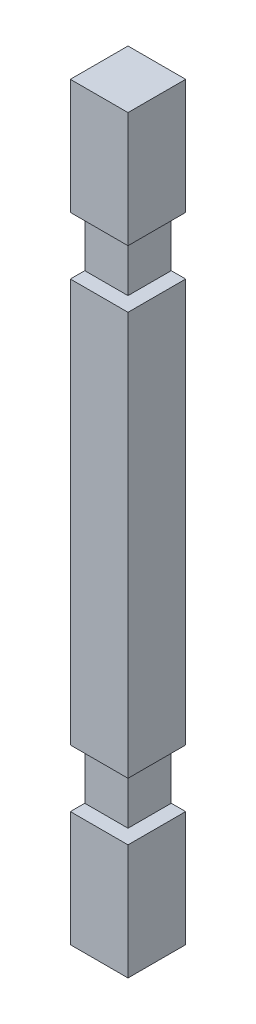
ISO-10303-21;
HEADER;
FILE_DESCRIPTION(('STEP AP214'),'2;1');
FILE_NAME('part.step','',(''),(''),'','','');
FILE_SCHEMA(('AUTOMOTIVE_DESIGN { 1 0 10303 214 1 1 1 1 }'));
ENDSEC;
DATA;
#1=APPLICATION_CONTEXT('core data for automotive mechanical design processes');
#2=APPLICATION_PROTOCOL_DEFINITION('international standard','automotive_design',2000,#1);
#3=PRODUCT_CONTEXT('',#1,'mechanical');
#4=PRODUCT('Part','Part','',(#3));
#5=PRODUCT_RELATED_PRODUCT_CATEGORY('part','',(#4));
#6=PRODUCT_DEFINITION_FORMATION('','',#4);
#7=PRODUCT_DEFINITION_CONTEXT('part definition',#1,'design');
#8=PRODUCT_DEFINITION('design','',#6,#7);
#9=PRODUCT_DEFINITION_SHAPE('','',#8);
#10=(LENGTH_UNIT() NAMED_UNIT(*) SI_UNIT(.MILLI.,.METRE.));
#11=(NAMED_UNIT(*) PLANE_ANGLE_UNIT() SI_UNIT($,.RADIAN.));
#12=(NAMED_UNIT(*) SI_UNIT($,.STERADIAN.) SOLID_ANGLE_UNIT());
#13=UNCERTAINTY_MEASURE_WITH_UNIT(LENGTH_MEASURE(1.E-05),#10,'distance_accuracy_value','');
#14=(GEOMETRIC_REPRESENTATION_CONTEXT(3) GLOBAL_UNCERTAINTY_ASSIGNED_CONTEXT((#13)) GLOBAL_UNIT_ASSIGNED_CONTEXT((#10,
#11,#12)) REPRESENTATION_CONTEXT('',''));
#15=CARTESIAN_POINT('',(0.,0.,0.));
#16=DIRECTION('',(0.,0.,1.));
#17=DIRECTION('',(1.,0.,0.));
#18=AXIS2_PLACEMENT_3D('',#15,#16,#17);
#19=CARTESIAN_POINT('',(25.3999999999999,330.2,50.8));
#20=DIRECTION('',(-1.,0.,0.));
#21=DIRECTION('',(0.,-1.,0.));
#22=AXIS2_PLACEMENT_3D('',#19,#20,#21);
#23=PLANE('',#22);
#24=DIRECTION('',(0.,0.,1.));
#25=VECTOR('',#24,1.);
#26=CARTESIAN_POINT('',(25.4,-177.8,38.1));
#27=LINE('',#26,#25);
#28=CARTESIAN_POINT('',(25.4,-177.8,0.));
#29=VERTEX_POINT('',#28);
#30=CARTESIAN_POINT('',(25.4,-177.8,50.8));
#31=VERTEX_POINT('',#30);
#32=EDGE_CURVE('E62',#29,#31,#27,.T.);
#33=ORIENTED_EDGE('',*,*,#32,.F.);
#34=DIRECTION('',(0.,1.,0.));
#35=VECTOR('',#34,1.);
#36=CARTESIAN_POINT('',(25.3999999999999,330.2,0.));
#37=LINE('',#36,#35);
#38=CARTESIAN_POINT('',(25.3999999999999,177.8,0.));
#39=VERTEX_POINT('',#38);
#40=EDGE_CURVE('E289',#29,#39,#37,.T.);
#41=ORIENTED_EDGE('',*,*,#40,.T.);
#42=DIRECTION('',(0.,0.,1.));
#43=VECTOR('',#42,1.);
#44=CARTESIAN_POINT('',(25.4,177.8,38.1));
#45=LINE('',#44,#43);
#46=CARTESIAN_POINT('',(25.4,177.8,50.8));
#47=VERTEX_POINT('',#46);
#48=EDGE_CURVE('E253',#39,#47,#45,.T.);
#49=ORIENTED_EDGE('',*,*,#48,.T.);
#50=DIRECTION('',(0.,1.,0.));
#51=VECTOR('',#50,1.);
#52=CARTESIAN_POINT('',(25.3999999999999,330.2,50.8));
#53=LINE('',#52,#51);
#54=EDGE_CURVE('E274',#31,#47,#53,.T.);
#55=ORIENTED_EDGE('',*,*,#54,.F.);
#56=EDGE_LOOP('',(#33,#41,#49,#55));
#57=FACE_BOUND('',#56,.T.);
#58=ADVANCED_FACE('F39',(#57),#23,.F.);
#59=CARTESIAN_POINT('',(0.,0.,38.1));
#60=DIRECTION('',(0.,0.,-1.));
#61=DIRECTION('',(-1.,0.,0.));
#62=AXIS2_PLACEMENT_3D('',#59,#60,#61);
#63=PLANE('',#62);
#64=DIRECTION('',(0.,-1.,0.));
#65=VECTOR('',#64,1.);
#66=CARTESIAN_POINT('',(12.6999999999999,0.,38.1));
#67=LINE('',#66,#65);
#68=CARTESIAN_POINT('',(12.7,-177.8,38.1));
#69=VERTEX_POINT('',#68);
#70=CARTESIAN_POINT('',(12.7,-228.6,38.1));
#71=VERTEX_POINT('',#70);
#72=EDGE_CURVE('E11',#69,#71,#67,.T.);
#73=ORIENTED_EDGE('',*,*,#72,.F.);
#74=DIRECTION('',(-1.,0.,0.));
#75=VECTOR('',#74,1.);
#76=CARTESIAN_POINT('',(25.4,-177.8,38.1));
#77=LINE('',#76,#75);
#78=CARTESIAN_POINT('',(-25.4,-177.8,38.1));
#79=VERTEX_POINT('',#78);
#80=EDGE_CURVE('E184',#69,#79,#77,.T.);
#81=ORIENTED_EDGE('',*,*,#80,.T.);
#82=DIRECTION('',(0.,-1.,0.));
#83=VECTOR('',#82,1.);
#84=CARTESIAN_POINT('',(-25.4,-177.8,38.1));
#85=LINE('',#84,#83);
#86=CARTESIAN_POINT('',(-25.4,-228.6,38.1));
#87=VERTEX_POINT('',#86);
#88=EDGE_CURVE('E187',#79,#87,#85,.T.);
#89=ORIENTED_EDGE('',*,*,#88,.T.);
#90=DIRECTION('',(1.,0.,0.));
#91=VECTOR('',#90,1.);
#92=CARTESIAN_POINT('',(25.4,-228.6,38.1));
#93=LINE('',#92,#91);
#94=EDGE_CURVE('E191',#87,#71,#93,.T.);
#95=ORIENTED_EDGE('',*,*,#94,.T.);
#96=EDGE_LOOP('',(#73,#81,#89,#95));
#97=FACE_BOUND('',#96,.T.);
#98=ADVANCED_FACE('F377',(#97),#63,.F.);
#99=CARTESIAN_POINT('',(0.,0.,50.8));
#100=DIRECTION('',(0.,0.,1.));
#101=DIRECTION('',(1.,0.,0.));
#102=AXIS2_PLACEMENT_3D('',#99,#100,#101);
#103=PLANE('',#102);
#104=DIRECTION('',(1.,0.,0.));
#105=VECTOR('',#104,1.);
#106=CARTESIAN_POINT('',(25.4,-228.6,50.8));
#107=LINE('',#106,#105);
#108=CARTESIAN_POINT('',(-25.4,-228.6,50.8));
#109=VERTEX_POINT('',#108);
#110=CARTESIAN_POINT('',(25.4,-228.6,50.8));
#111=VERTEX_POINT('',#110);
#112=EDGE_CURVE('E188',#109,#111,#107,.T.);
#113=ORIENTED_EDGE('',*,*,#112,.F.);
#114=DIRECTION('',(0.,-1.,0.));
#115=VECTOR('',#114,1.);
#116=CARTESIAN_POINT('',(-25.4,330.2,50.8));
#117=LINE('',#116,#115);
#118=CARTESIAN_POINT('',(-25.4,-330.2,50.8));
#119=VERTEX_POINT('',#118);
#120=EDGE_CURVE('E265',#109,#119,#117,.T.);
#121=ORIENTED_EDGE('',*,*,#120,.T.);
#122=DIRECTION('',(1.,0.,0.));
#123=VECTOR('',#122,1.);
#124=CARTESIAN_POINT('',(-25.4,-330.2,50.8));
#125=LINE('',#124,#123);
#126=CARTESIAN_POINT('',(25.4,-330.2,50.8));
#127=VERTEX_POINT('',#126);
#128=EDGE_CURVE('E263',#119,#127,#125,.T.);
#129=ORIENTED_EDGE('',*,*,#128,.T.);
#130=EDGE_CURVE('E269',#127,#111,#53,.T.);
#131=ORIENTED_EDGE('',*,*,#130,.T.);
#132=EDGE_LOOP('',(#113,#121,#129,#131));
#133=FACE_BOUND('',#132,.T.);
#134=ADVANCED_FACE('F383',(#133),#103,.T.);
#135=DIRECTION('',(0.,0.,1.));
#136=VECTOR('',#135,1.);
#137=CARTESIAN_POINT('',(25.4,228.6,38.1));
#138=LINE('',#137,#136);
#139=CARTESIAN_POINT('',(25.3999999999999,228.6,0.));
#140=VERTEX_POINT('',#139);
#141=CARTESIAN_POINT('',(25.4,228.6,50.8));
#142=VERTEX_POINT('',#141);
#143=EDGE_CURVE('E250',#140,#142,#138,.T.);
#144=ORIENTED_EDGE('',*,*,#143,.F.);
#145=CARTESIAN_POINT('',(25.3999999999999,330.2,0.));
#146=VERTEX_POINT('',#145);
#147=EDGE_CURVE('E284',#140,#146,#37,.T.);
#148=ORIENTED_EDGE('',*,*,#147,.T.);
#149=DIRECTION('',(0.,0.,-1.));
#150=VECTOR('',#149,1.);
#151=CARTESIAN_POINT('',(25.3999999999999,330.2,50.8));
#152=LINE('',#151,#150);
#153=CARTESIAN_POINT('',(25.3999999999999,330.2,50.8));
#154=VERTEX_POINT('',#153);
#155=EDGE_CURVE('E295',#154,#146,#152,.T.);
#156=ORIENTED_EDGE('',*,*,#155,.F.);
#157=EDGE_CURVE('E268',#142,#154,#53,.T.);
#158=ORIENTED_EDGE('',*,*,#157,.F.);
#159=EDGE_LOOP('',(#144,#148,#156,#158));
#160=FACE_BOUND('',#159,.T.);
#161=ADVANCED_FACE('F343',(#160),#23,.F.);
#162=CARTESIAN_POINT('',(0.,0.,38.1));
#163=DIRECTION('',(0.,0.,1.));
#164=DIRECTION('',(1.,0.,0.));
#165=AXIS2_PLACEMENT_3D('',#162,#163,#164);
#166=PLANE('',#165);
#167=DIRECTION('',(1.,0.,0.));
#168=VECTOR('',#167,1.);
#169=CARTESIAN_POINT('',(-25.4,177.8,38.1));
#170=LINE('',#169,#168);
#171=CARTESIAN_POINT('',(-25.4,177.8,38.1));
#172=VERTEX_POINT('',#171);
#173=CARTESIAN_POINT('',(12.6999999999999,177.8,38.1));
#174=VERTEX_POINT('',#173);
#175=EDGE_CURVE('E231',#172,#174,#170,.T.);
#176=ORIENTED_EDGE('',*,*,#175,.T.);
#177=DIRECTION('',(0.,1.,0.));
#178=VECTOR('',#177,1.);
#179=CARTESIAN_POINT('',(12.7,0.,38.1));
#180=LINE('',#179,#178);
#181=CARTESIAN_POINT('',(12.6999999999999,228.6,38.1));
#182=VERTEX_POINT('',#181);
#183=EDGE_CURVE('E48',#174,#182,#180,.T.);
#184=ORIENTED_EDGE('',*,*,#183,.T.);
#185=DIRECTION('',(-1.,0.,0.));
#186=VECTOR('',#185,1.);
#187=CARTESIAN_POINT('',(-25.4,228.6,38.1));
#188=LINE('',#187,#186);
#189=CARTESIAN_POINT('',(-25.4,228.6,38.1));
#190=VERTEX_POINT('',#189);
#191=EDGE_CURVE('E236',#182,#190,#188,.T.);
#192=ORIENTED_EDGE('',*,*,#191,.T.);
#193=DIRECTION('',(0.,-1.,0.));
#194=VECTOR('',#193,1.);
#195=CARTESIAN_POINT('',(-25.4,228.6,38.1));
#196=LINE('',#195,#194);
#197=EDGE_CURVE('E227',#190,#172,#196,.T.);
#198=ORIENTED_EDGE('',*,*,#197,.T.);
#199=EDGE_LOOP('',(#176,#184,#192,#198));
#200=FACE_BOUND('',#199,.T.);
#201=ADVANCED_FACE('F310',(#200),#166,.T.);
#202=DIRECTION('',(-1.,0.,0.));
#203=VECTOR('',#202,1.);
#204=CARTESIAN_POINT('',(-25.4,228.6,50.8));
#205=LINE('',#204,#203);
#206=CARTESIAN_POINT('',(-25.4,228.6,50.8));
#207=VERTEX_POINT('',#206);
#208=EDGE_CURVE('E232',#142,#207,#205,.T.);
#209=ORIENTED_EDGE('',*,*,#208,.F.);
#210=ORIENTED_EDGE('',*,*,#157,.T.);
#211=DIRECTION('',(-1.,0.,0.));
#212=VECTOR('',#211,1.);
#213=CARTESIAN_POINT('',(-25.4,330.2,50.8));
#214=LINE('',#213,#212);
#215=CARTESIAN_POINT('',(-25.4,330.2,50.8));
#216=VERTEX_POINT('',#215);
#217=EDGE_CURVE('E273',#154,#216,#214,.T.);
#218=ORIENTED_EDGE('',*,*,#217,.T.);
#219=EDGE_CURVE('E259',#216,#207,#117,.T.);
#220=ORIENTED_EDGE('',*,*,#219,.T.);
#221=EDGE_LOOP('',(#209,#210,#218,#220));
#222=FACE_BOUND('',#221,.T.);
#223=ADVANCED_FACE('F339',(#222),#103,.T.);
#224=CARTESIAN_POINT('',(-25.4,330.2,50.8));
#225=DIRECTION('',(1.,0.,0.));
#226=DIRECTION('',(0.,1.,0.));
#227=AXIS2_PLACEMENT_3D('',#224,#225,#226);
#228=PLANE('',#227);
#229=CARTESIAN_POINT('',(-25.4,-304.8,25.4));
#230=DIRECTION('',(-1.,0.,0.));
#231=DIRECTION('',(0.,-1.,0.));
#232=AXIS2_PLACEMENT_3D('',#229,#230,#231);
#233=CIRCLE('',#232,8.);
#234=CARTESIAN_POINT('',(-25.4,-312.8,25.4));
#235=VERTEX_POINT('',#234);
#236=EDGE_CURVE('E441',#235,#235,#233,.T.);
#237=ORIENTED_EDGE('',*,*,#236,.F.);
#238=EDGE_LOOP('',(#237));
#239=FACE_BOUND('',#238,.T.);
#240=CARTESIAN_POINT('',(-25.4,304.8,25.4));
#241=DIRECTION('',(-1.,0.,0.));
#242=DIRECTION('',(0.,-1.,0.));
#243=AXIS2_PLACEMENT_3D('',#240,#241,#242);
#244=CIRCLE('',#243,8.);
#245=CARTESIAN_POINT('',(-25.4,296.8,25.4));
#246=VERTEX_POINT('',#245);
#247=EDGE_CURVE('E453',#246,#246,#244,.T.);
#248=ORIENTED_EDGE('',*,*,#247,.F.);
#249=EDGE_LOOP('',(#248));
#250=FACE_BOUND('',#249,.T.);
#251=ORIENTED_EDGE('',*,*,#120,.F.);
#252=DIRECTION('',(0.,0.,1.));
#253=VECTOR('',#252,1.);
#254=CARTESIAN_POINT('',(-25.4,-228.6,38.1));
#255=LINE('',#254,#253);
#256=EDGE_CURVE('E201',#87,#109,#255,.T.);
#257=ORIENTED_EDGE('',*,*,#256,.F.);
#258=ORIENTED_EDGE('',*,*,#88,.F.);
#259=DIRECTION('',(0.,0.,1.));
#260=VECTOR('',#259,1.);
#261=CARTESIAN_POINT('',(-25.4,-177.8,38.1));
#262=LINE('',#261,#260);
#263=CARTESIAN_POINT('',(-25.4,-177.8,50.8));
#264=VERTEX_POINT('',#263);
#265=EDGE_CURVE('E204',#79,#264,#262,.T.);
#266=ORIENTED_EDGE('',*,*,#265,.T.);
#267=CARTESIAN_POINT('',(-25.4,177.8,50.8));
#268=VERTEX_POINT('',#267);
#269=EDGE_CURVE('E264',#268,#264,#117,.T.);
#270=ORIENTED_EDGE('',*,*,#269,.F.);
#271=DIRECTION('',(0.,0.,1.));
#272=VECTOR('',#271,1.);
#273=CARTESIAN_POINT('',(-25.4,177.8,38.1));
#274=LINE('',#273,#272);
#275=EDGE_CURVE('E239',#172,#268,#274,.T.);
#276=ORIENTED_EDGE('',*,*,#275,.F.);
#277=ORIENTED_EDGE('',*,*,#197,.F.);
#278=DIRECTION('',(0.,0.,1.));
#279=VECTOR('',#278,1.);
#280=CARTESIAN_POINT('',(-25.4,228.6,38.1));
#281=LINE('',#280,#279);
#282=EDGE_CURVE('E245',#190,#207,#281,.T.);
#283=ORIENTED_EDGE('',*,*,#282,.T.);
#284=ORIENTED_EDGE('',*,*,#219,.F.);
#285=DIRECTION('',(0.,0.,-1.));
#286=VECTOR('',#285,1.);
#287=CARTESIAN_POINT('',(-25.4,330.2,50.8));
#288=LINE('',#287,#286);
#289=CARTESIAN_POINT('',(-25.4,330.2,0.));
#290=VERTEX_POINT('',#289);
#291=EDGE_CURVE('E277',#216,#290,#288,.T.);
#292=ORIENTED_EDGE('',*,*,#291,.T.);
#293=DIRECTION('',(0.,-1.,0.));
#294=VECTOR('',#293,1.);
#295=CARTESIAN_POINT('',(-25.4,330.2,0.));
#296=LINE('',#295,#294);
#297=CARTESIAN_POINT('',(-25.4,-330.2,0.));
#298=VERTEX_POINT('',#297);
#299=EDGE_CURVE('E249',#290,#298,#296,.T.);
#300=ORIENTED_EDGE('',*,*,#299,.T.);
#301=DIRECTION('',(0.,0.,-1.));
#302=VECTOR('',#301,1.);
#303=CARTESIAN_POINT('',(-25.4,-330.2,50.8));
#304=LINE('',#303,#302);
#305=EDGE_CURVE('E303',#119,#298,#304,.T.);
#306=ORIENTED_EDGE('',*,*,#305,.F.);
#307=EDGE_LOOP('',(#251,#257,#258,#266,#270,#276,#277,#283,#284,#292,#300,#306));
#308=FACE_BOUND('',#307,.T.);
#309=ADVANCED_FACE('F41',(#239,#250,#308),#228,.F.);
#310=CARTESIAN_POINT('',(-25.4,-330.2,50.8));
#311=DIRECTION('',(0.,1.,0.));
#312=DIRECTION('',(0.,0.,1.));
#313=AXIS2_PLACEMENT_3D('',#310,#311,#312);
#314=PLANE('',#313);
#315=DIRECTION('',(1.,0.,0.));
#316=VECTOR('',#315,1.);
#317=CARTESIAN_POINT('',(-25.4,-330.2,0.));
#318=LINE('',#317,#316);
#319=CARTESIAN_POINT('',(25.4,-330.2,0.));
#320=VERTEX_POINT('',#319);
#321=EDGE_CURVE('E281',#298,#320,#318,.T.);
#322=ORIENTED_EDGE('',*,*,#321,.T.);
#323=DIRECTION('',(0.,0.,-1.));
#324=VECTOR('',#323,1.);
#325=CARTESIAN_POINT('',(25.4,-330.2,50.8));
#326=LINE('',#325,#324);
#327=EDGE_CURVE('E299',#127,#320,#326,.T.);
#328=ORIENTED_EDGE('',*,*,#327,.F.);
#329=ORIENTED_EDGE('',*,*,#128,.F.);
#330=ORIENTED_EDGE('',*,*,#305,.T.);
#331=EDGE_LOOP('',(#322,#328,#329,#330));
#332=FACE_BOUND('',#331,.T.);
#333=ADVANCED_FACE('F353',(#332),#314,.F.);
#334=CARTESIAN_POINT('',(25.4,-228.6,0.));
#335=VERTEX_POINT('',#334);
#336=EDGE_CURVE('E285',#320,#335,#37,.T.);
#337=ORIENTED_EDGE('',*,*,#336,.T.);
#338=DIRECTION('',(0.,0.,1.));
#339=VECTOR('',#338,1.);
#340=CARTESIAN_POINT('',(25.4,-228.6,38.1));
#341=LINE('',#340,#339);
#342=EDGE_CURVE('E165',#335,#111,#341,.T.);
#343=ORIENTED_EDGE('',*,*,#342,.T.);
#344=ORIENTED_EDGE('',*,*,#130,.F.);
#345=ORIENTED_EDGE('',*,*,#327,.T.);
#346=EDGE_LOOP('',(#337,#343,#344,#345));
#347=FACE_BOUND('',#346,.T.);
#348=ADVANCED_FACE('F379',(#347),#23,.F.);
#349=CARTESIAN_POINT('',(-25.4,330.2,50.8));
#350=DIRECTION('',(0.,-1.,0.));
#351=DIRECTION('',(0.,0.,-1.));
#352=AXIS2_PLACEMENT_3D('',#349,#350,#351);
#353=PLANE('',#352);
#354=DIRECTION('',(-1.,0.,0.));
#355=VECTOR('',#354,1.);
#356=CARTESIAN_POINT('',(-25.4,330.2,0.));
#357=LINE('',#356,#355);
#358=EDGE_CURVE('E288',#146,#290,#357,.T.);
#359=ORIENTED_EDGE('',*,*,#358,.T.);
#360=ORIENTED_EDGE('',*,*,#291,.F.);
#361=ORIENTED_EDGE('',*,*,#217,.F.);
#362=ORIENTED_EDGE('',*,*,#155,.T.);
#363=EDGE_LOOP('',(#359,#360,#361,#362));
#364=FACE_BOUND('',#363,.T.);
#365=ADVANCED_FACE('F347',(#364),#353,.F.);
#366=DIRECTION('',(-1.,0.,0.));
#367=VECTOR('',#366,1.);
#368=CARTESIAN_POINT('',(25.4,-177.8,50.8));
#369=LINE('',#368,#367);
#370=EDGE_CURVE('E182',#31,#264,#369,.T.);
#371=ORIENTED_EDGE('',*,*,#370,.F.);
#372=ORIENTED_EDGE('',*,*,#54,.T.);
#373=DIRECTION('',(1.,0.,0.));
#374=VECTOR('',#373,1.);
#375=CARTESIAN_POINT('',(-25.4,177.8,50.8));
#376=LINE('',#375,#374);
#377=EDGE_CURVE('E223',#268,#47,#376,.T.);
#378=ORIENTED_EDGE('',*,*,#377,.F.);
#379=ORIENTED_EDGE('',*,*,#269,.T.);
#380=EDGE_LOOP('',(#371,#372,#378,#379));
#381=FACE_BOUND('',#380,.T.);
#382=ADVANCED_FACE('F331',(#381),#103,.T.);
#383=CARTESIAN_POINT('',(0.,0.,0.));
#384=DIRECTION('',(0.,0.,1.));
#385=DIRECTION('',(1.,0.,0.));
#386=AXIS2_PLACEMENT_3D('',#383,#384,#385);
#387=PLANE('',#386);
#388=CARTESIAN_POINT('',(0.,-304.8,0.));
#389=DIRECTION('',(0.,0.,-1.));
#390=DIRECTION('',(-1.,0.,0.));
#391=AXIS2_PLACEMENT_3D('',#388,#389,#390);
#392=CIRCLE('',#391,8.00000000000002);
#393=CARTESIAN_POINT('',(-7.99999999999999,-304.8,0.));
#394=VERTEX_POINT('',#393);
#395=EDGE_CURVE('E440',#394,#394,#392,.T.);
#396=ORIENTED_EDGE('',*,*,#395,.F.);
#397=EDGE_LOOP('',(#396));
#398=FACE_BOUND('',#397,.T.);
#399=CARTESIAN_POINT('',(-1.11022302462516E-13,304.8,0.));
#400=DIRECTION('',(0.,0.,-1.));
#401=DIRECTION('',(-1.,0.,0.));
#402=AXIS2_PLACEMENT_3D('',#399,#400,#401);
#403=CIRCLE('',#402,8.00000000000002);
#404=CARTESIAN_POINT('',(-8.00000000000013,304.8,0.));
#405=VERTEX_POINT('',#404);
#406=EDGE_CURVE('E459',#405,#405,#403,.T.);
#407=ORIENTED_EDGE('',*,*,#406,.F.);
#408=EDGE_LOOP('',(#407));
#409=FACE_BOUND('',#408,.T.);
#410=ORIENTED_EDGE('',*,*,#40,.F.);
#411=DIRECTION('',(1.,0.,0.));
#412=VECTOR('',#411,1.);
#413=CARTESIAN_POINT('',(12.7,-177.8,0.));
#414=LINE('',#413,#412);
#415=CARTESIAN_POINT('',(12.7,-177.8,0.));
#416=VERTEX_POINT('',#415);
#417=EDGE_CURVE('E170',#416,#29,#414,.T.);
#418=ORIENTED_EDGE('',*,*,#417,.F.);
#419=DIRECTION('',(0.,1.,0.));
#420=VECTOR('',#419,1.);
#421=CARTESIAN_POINT('',(12.7,-177.8,0.));
#422=LINE('',#421,#420);
#423=CARTESIAN_POINT('',(12.7,-228.6,0.));
#424=VERTEX_POINT('',#423);
#425=EDGE_CURVE('E154',#424,#416,#422,.T.);
#426=ORIENTED_EDGE('',*,*,#425,.F.);
#427=DIRECTION('',(1.,0.,0.));
#428=VECTOR('',#427,1.);
#429=CARTESIAN_POINT('',(12.7,-228.6,0.));
#430=LINE('',#429,#428);
#431=EDGE_CURVE('E162',#424,#335,#430,.T.);
#432=ORIENTED_EDGE('',*,*,#431,.T.);
#433=ORIENTED_EDGE('',*,*,#336,.F.);
#434=ORIENTED_EDGE('',*,*,#321,.F.);
#435=ORIENTED_EDGE('',*,*,#299,.F.);
#436=ORIENTED_EDGE('',*,*,#358,.F.);
#437=ORIENTED_EDGE('',*,*,#147,.F.);
#438=DIRECTION('',(1.,0.,0.));
#439=VECTOR('',#438,1.);
#440=CARTESIAN_POINT('',(12.6999999999999,228.6,0.));
#441=LINE('',#440,#439);
#442=CARTESIAN_POINT('',(12.6999999999999,228.6,0.));
#443=VERTEX_POINT('',#442);
#444=EDGE_CURVE('E219',#443,#140,#441,.T.);
#445=ORIENTED_EDGE('',*,*,#444,.F.);
#446=DIRECTION('',(0.,1.,0.));
#447=VECTOR('',#446,1.);
#448=CARTESIAN_POINT('',(12.6999999999999,228.6,0.));
#449=LINE('',#448,#447);
#450=CARTESIAN_POINT('',(12.6999999999999,177.8,0.));
#451=VERTEX_POINT('',#450);
#452=EDGE_CURVE('E212',#451,#443,#449,.T.);
#453=ORIENTED_EDGE('',*,*,#452,.F.);
#454=DIRECTION('',(1.,0.,0.));
#455=VECTOR('',#454,1.);
#456=CARTESIAN_POINT('',(12.6999999999999,177.8,0.));
#457=LINE('',#456,#455);
#458=EDGE_CURVE('E218',#451,#39,#457,.T.);
#459=ORIENTED_EDGE('',*,*,#458,.T.);
#460=EDGE_LOOP('',(#410,#418,#426,#432,#433,#434,#435,#436,#437,#445,#453,#459));
#461=FACE_BOUND('',#460,.T.);
#462=ADVANCED_FACE('F174',(#398,#409,#461),#387,.F.);
#463=CARTESIAN_POINT('',(-25.4,228.6,38.1));
#464=DIRECTION('',(0.,1.,0.));
#465=DIRECTION('',(0.,0.,1.));
#466=AXIS2_PLACEMENT_3D('',#463,#464,#465);
#467=PLANE('',#466);
#468=ORIENTED_EDGE('',*,*,#208,.T.);
#469=ORIENTED_EDGE('',*,*,#282,.F.);
#470=ORIENTED_EDGE('',*,*,#191,.F.);
#471=DIRECTION('',(0.,0.,1.));
#472=VECTOR('',#471,1.);
#473=CARTESIAN_POINT('',(12.6999999999999,228.6,50.8));
#474=LINE('',#473,#472);
#475=EDGE_CURVE('E215',#443,#182,#474,.T.);
#476=ORIENTED_EDGE('',*,*,#475,.F.);
#477=ORIENTED_EDGE('',*,*,#444,.T.);
#478=ORIENTED_EDGE('',*,*,#143,.T.);
#479=EDGE_LOOP('',(#468,#469,#470,#476,#477,#478));
#480=FACE_BOUND('',#479,.T.);
#481=ADVANCED_FACE('F316',(#480),#467,.F.);
#482=CARTESIAN_POINT('',(-25.4,177.8,38.1));
#483=DIRECTION('',(0.,-1.,0.));
#484=DIRECTION('',(1.,0.,0.));
#485=AXIS2_PLACEMENT_3D('',#482,#483,#484);
#486=PLANE('',#485);
#487=ORIENTED_EDGE('',*,*,#48,.F.);
#488=ORIENTED_EDGE('',*,*,#458,.F.);
#489=DIRECTION('',(0.,0.,-1.));
#490=VECTOR('',#489,1.);
#491=CARTESIAN_POINT('',(12.6999999999999,177.8,50.8));
#492=LINE('',#491,#490);
#493=EDGE_CURVE('E200',#174,#451,#492,.T.);
#494=ORIENTED_EDGE('',*,*,#493,.F.);
#495=ORIENTED_EDGE('',*,*,#175,.F.);
#496=ORIENTED_EDGE('',*,*,#275,.T.);
#497=ORIENTED_EDGE('',*,*,#377,.T.);
#498=EDGE_LOOP('',(#487,#488,#494,#495,#496,#497));
#499=FACE_BOUND('',#498,.T.);
#500=ADVANCED_FACE('F329',(#499),#486,.F.);
#501=CARTESIAN_POINT('',(12.7,0.,0.));
#502=DIRECTION('',(1.,0.,0.));
#503=DIRECTION('',(0.,1.,0.));
#504=AXIS2_PLACEMENT_3D('',#501,#502,#503);
#505=PLANE('',#504);
#506=ORIENTED_EDGE('',*,*,#493,.T.);
#507=ORIENTED_EDGE('',*,*,#452,.T.);
#508=ORIENTED_EDGE('',*,*,#475,.T.);
#509=ORIENTED_EDGE('',*,*,#183,.F.);
#510=EDGE_LOOP('',(#506,#507,#508,#509));
#511=FACE_BOUND('',#510,.T.);
#512=ADVANCED_FACE('F364',(#511),#505,.T.);
#513=CARTESIAN_POINT('',(25.4,-228.6,38.1));
#514=DIRECTION('',(0.,-1.,0.));
#515=DIRECTION('',(0.,0.,-1.));
#516=AXIS2_PLACEMENT_3D('',#513,#514,#515);
#517=PLANE('',#516);
#518=ORIENTED_EDGE('',*,*,#342,.F.);
#519=ORIENTED_EDGE('',*,*,#431,.F.);
#520=DIRECTION('',(0.,0.,-1.));
#521=VECTOR('',#520,1.);
#522=CARTESIAN_POINT('',(12.7,-228.6,50.8));
#523=LINE('',#522,#521);
#524=EDGE_CURVE('E150',#71,#424,#523,.T.);
#525=ORIENTED_EDGE('',*,*,#524,.F.);
#526=ORIENTED_EDGE('',*,*,#94,.F.);
#527=ORIENTED_EDGE('',*,*,#256,.T.);
#528=ORIENTED_EDGE('',*,*,#112,.T.);
#529=EDGE_LOOP('',(#518,#519,#525,#526,#527,#528));
#530=FACE_BOUND('',#529,.T.);
#531=ADVANCED_FACE('F163',(#530),#517,.F.);
#532=CARTESIAN_POINT('',(25.4,-177.8,38.1));
#533=DIRECTION('',(0.,1.,0.));
#534=DIRECTION('',(0.,0.,1.));
#535=AXIS2_PLACEMENT_3D('',#532,#533,#534);
#536=PLANE('',#535);
#537=ORIENTED_EDGE('',*,*,#370,.T.);
#538=ORIENTED_EDGE('',*,*,#265,.F.);
#539=ORIENTED_EDGE('',*,*,#80,.F.);
#540=DIRECTION('',(0.,0.,1.));
#541=VECTOR('',#540,1.);
#542=CARTESIAN_POINT('',(12.7,-177.8,50.8));
#543=LINE('',#542,#541);
#544=EDGE_CURVE('E54',#416,#69,#543,.T.);
#545=ORIENTED_EDGE('',*,*,#544,.F.);
#546=ORIENTED_EDGE('',*,*,#417,.T.);
#547=ORIENTED_EDGE('',*,*,#32,.T.);
#548=EDGE_LOOP('',(#537,#538,#539,#545,#546,#547));
#549=FACE_BOUND('',#548,.T.);
#550=ADVANCED_FACE('F371',(#549),#536,.F.);
#551=CARTESIAN_POINT('',(12.6999999999999,0.,0.));
#552=DIRECTION('',(1.,0.,0.));
#553=DIRECTION('',(0.,1.,0.));
#554=AXIS2_PLACEMENT_3D('',#551,#552,#553);
#555=PLANE('',#554);
#556=ORIENTED_EDGE('',*,*,#72,.T.);
#557=ORIENTED_EDGE('',*,*,#524,.T.);
#558=ORIENTED_EDGE('',*,*,#425,.T.);
#559=ORIENTED_EDGE('',*,*,#544,.T.);
#560=EDGE_LOOP('',(#556,#557,#558,#559));
#561=FACE_BOUND('',#560,.T.);
#562=ADVANCED_FACE('F152',(#561),#555,.T.);
#563=CARTESIAN_POINT('',(-1.11022302462516E-13,304.8,16.));
#564=DIRECTION('',(0.,0.,-1.));
#565=DIRECTION('',(-1.,0.,0.));
#566=AXIS2_PLACEMENT_3D('',#563,#564,#565);
#567=CYLINDRICAL_SURFACE('',#566,8.00000000000002);
#568=CARTESIAN_POINT('',(-1.11022302462516E-13,304.8,16.));
#569=DIRECTION('',(0.,0.,-1.));
#570=DIRECTION('',(-1.,0.,0.));
#571=AXIS2_PLACEMENT_3D('',#568,#569,#570);
#572=CIRCLE('',#571,8.00000000000002);
#573=CARTESIAN_POINT('',(-8.00000000000013,304.8,16.));
#574=VERTEX_POINT('',#573);
#575=EDGE_CURVE('E159',#574,#574,#572,.T.);
#576=ORIENTED_EDGE('',*,*,#575,.F.);
#577=EDGE_LOOP('',(#576));
#578=FACE_BOUND('',#577,.T.);
#579=ORIENTED_EDGE('',*,*,#406,.T.);
#580=EDGE_LOOP('',(#579));
#581=FACE_BOUND('',#580,.T.);
#582=ADVANCED_FACE('F401',(#578,#581),#567,.F.);
#583=CARTESIAN_POINT('',(-1.11022302462516E-13,304.8,16.));
#584=DIRECTION('',(0.,0.,-1.));
#585=DIRECTION('',(-1.,0.,0.));
#586=AXIS2_PLACEMENT_3D('',#583,#584,#585);
#587=PLANE('',#586);
#588=ORIENTED_EDGE('',*,*,#575,.T.);
#589=EDGE_LOOP('',(#588));
#590=FACE_BOUND('',#589,.T.);
#591=ADVANCED_FACE('F406',(#590),#587,.T.);
#592=CARTESIAN_POINT('',(-9.40000000000004,304.8,25.4));
#593=DIRECTION('',(-1.,0.,0.));
#594=DIRECTION('',(0.,-1.,0.));
#595=AXIS2_PLACEMENT_3D('',#592,#593,#594);
#596=CYLINDRICAL_SURFACE('',#595,8.);
#597=CARTESIAN_POINT('',(-9.40000000000004,304.8,25.4));
#598=DIRECTION('',(-1.,0.,0.));
#599=DIRECTION('',(0.,-1.,0.));
#600=AXIS2_PLACEMENT_3D('',#597,#598,#599);
#601=CIRCLE('',#600,8.);
#602=CARTESIAN_POINT('',(-9.40000000000004,296.8,25.4));
#603=VERTEX_POINT('',#602);
#604=EDGE_CURVE('E455',#603,#603,#601,.T.);
#605=ORIENTED_EDGE('',*,*,#604,.F.);
#606=EDGE_LOOP('',(#605));
#607=FACE_BOUND('',#606,.T.);
#608=ORIENTED_EDGE('',*,*,#247,.T.);
#609=EDGE_LOOP('',(#608));
#610=FACE_BOUND('',#609,.T.);
#611=ADVANCED_FACE('F410',(#607,#610),#596,.F.);
#612=CARTESIAN_POINT('',(-9.40000000000004,304.8,25.4));
#613=DIRECTION('',(-1.,0.,0.));
#614=DIRECTION('',(0.,-1.,0.));
#615=AXIS2_PLACEMENT_3D('',#612,#613,#614);
#616=PLANE('',#615);
#617=ORIENTED_EDGE('',*,*,#604,.T.);
#618=EDGE_LOOP('',(#617));
#619=FACE_BOUND('',#618,.T.);
#620=ADVANCED_FACE('F414',(#619),#616,.T.);
#621=CARTESIAN_POINT('',(0.,-304.8,16.));
#622=DIRECTION('',(0.,0.,-1.));
#623=DIRECTION('',(-1.,0.,0.));
#624=AXIS2_PLACEMENT_3D('',#621,#622,#623);
#625=CYLINDRICAL_SURFACE('',#624,8.00000000000002);
#626=CARTESIAN_POINT('',(0.,-304.8,16.));
#627=DIRECTION('',(0.,0.,-1.));
#628=DIRECTION('',(-1.,0.,0.));
#629=AXIS2_PLACEMENT_3D('',#626,#627,#628);
#630=CIRCLE('',#629,8.00000000000002);
#631=CARTESIAN_POINT('',(-7.99999999999999,-304.8,16.));
#632=VERTEX_POINT('',#631);
#633=EDGE_CURVE('E446',#632,#632,#630,.T.);
#634=ORIENTED_EDGE('',*,*,#633,.F.);
#635=EDGE_LOOP('',(#634));
#636=FACE_BOUND('',#635,.T.);
#637=ORIENTED_EDGE('',*,*,#395,.T.);
#638=EDGE_LOOP('',(#637));
#639=FACE_BOUND('',#638,.T.);
#640=ADVANCED_FACE('F418',(#636,#639),#625,.F.);
#641=CARTESIAN_POINT('',(0.,-304.8,16.));
#642=DIRECTION('',(0.,0.,-1.));
#643=DIRECTION('',(-1.,0.,0.));
#644=AXIS2_PLACEMENT_3D('',#641,#642,#643);
#645=PLANE('',#644);
#646=ORIENTED_EDGE('',*,*,#633,.T.);
#647=EDGE_LOOP('',(#646));
#648=FACE_BOUND('',#647,.T.);
#649=ADVANCED_FACE('F422',(#648),#645,.T.);
#650=CARTESIAN_POINT('',(-9.39999999999997,-304.8,25.4));
#651=DIRECTION('',(-1.,0.,0.));
#652=DIRECTION('',(0.,-1.,0.));
#653=AXIS2_PLACEMENT_3D('',#650,#651,#652);
#654=CYLINDRICAL_SURFACE('',#653,8.);
#655=CARTESIAN_POINT('',(-9.39999999999997,-304.8,25.4));
#656=DIRECTION('',(-1.,0.,0.));
#657=DIRECTION('',(0.,-1.,0.));
#658=AXIS2_PLACEMENT_3D('',#655,#656,#657);
#659=CIRCLE('',#658,8.);
#660=CARTESIAN_POINT('',(-9.39999999999996,-312.8,25.4));
#661=VERTEX_POINT('',#660);
#662=EDGE_CURVE('E438',#661,#661,#659,.T.);
#663=ORIENTED_EDGE('',*,*,#662,.F.);
#664=EDGE_LOOP('',(#663));
#665=FACE_BOUND('',#664,.T.);
#666=ORIENTED_EDGE('',*,*,#236,.T.);
#667=EDGE_LOOP('',(#666));
#668=FACE_BOUND('',#667,.T.);
#669=ADVANCED_FACE('F426',(#665,#668),#654,.F.);
#670=CARTESIAN_POINT('',(-9.39999999999997,-304.8,25.4));
#671=DIRECTION('',(-1.,0.,0.));
#672=DIRECTION('',(0.,-1.,0.));
#673=AXIS2_PLACEMENT_3D('',#670,#671,#672);
#674=PLANE('',#673);
#675=ORIENTED_EDGE('',*,*,#662,.T.);
#676=EDGE_LOOP('',(#675));
#677=FACE_BOUND('',#676,.T.);
#678=ADVANCED_FACE('F430',(#677),#674,.T.);
#679=CLOSED_SHELL('',(#58,#98,#134,#161,#201,#223,#309,#333,#348,#365,#382,#462,#481,#500,#512,
#531,#550,#562,#582,#591,#611,#620,#640,#649,#669,#678));
#680=MANIFOLD_SOLID_BREP('B2',#679);
#681=ADVANCED_BREP_SHAPE_REPRESENTATION('',(#18,#680),#14);
#682=SHAPE_DEFINITION_REPRESENTATION(#9,#681);
ENDSEC;
END-ISO-10303-21;
